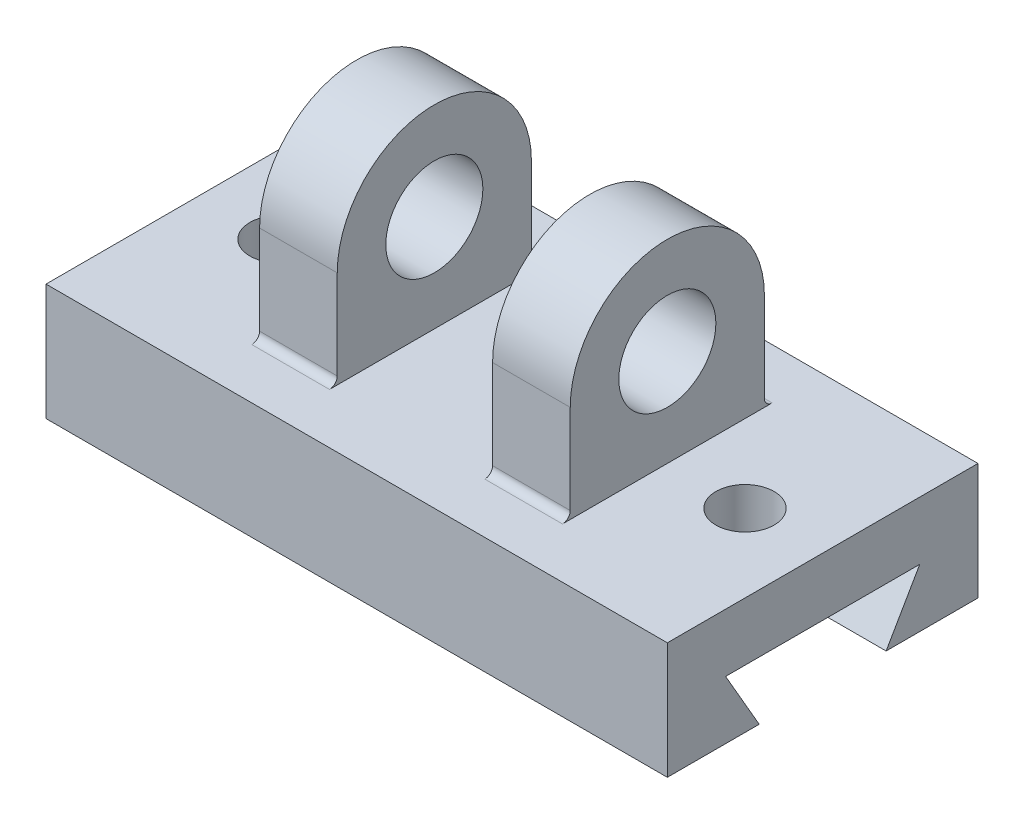
ISO-10303-21;
HEADER;
FILE_DESCRIPTION(('STEP AP214'),'2;1');
FILE_NAME('part.step','',(''),(''),'','','');
FILE_SCHEMA(('AUTOMOTIVE_DESIGN { 1 0 10303 214 1 1 1 1 }'));
ENDSEC;
DATA;
#1=APPLICATION_CONTEXT('core data for automotive mechanical design processes');
#2=APPLICATION_PROTOCOL_DEFINITION('international standard','automotive_design',2000,#1);
#3=PRODUCT_CONTEXT('',#1,'mechanical');
#4=PRODUCT('Part','Part','',(#3));
#5=PRODUCT_RELATED_PRODUCT_CATEGORY('part','',(#4));
#6=PRODUCT_DEFINITION_FORMATION('','',#4);
#7=PRODUCT_DEFINITION_CONTEXT('part definition',#1,'design');
#8=PRODUCT_DEFINITION('design','',#6,#7);
#9=PRODUCT_DEFINITION_SHAPE('','',#8);
#10=(LENGTH_UNIT() NAMED_UNIT(*) SI_UNIT(.MILLI.,.METRE.));
#11=(NAMED_UNIT(*) PLANE_ANGLE_UNIT() SI_UNIT($,.RADIAN.));
#12=(NAMED_UNIT(*) SI_UNIT($,.STERADIAN.) SOLID_ANGLE_UNIT());
#13=UNCERTAINTY_MEASURE_WITH_UNIT(LENGTH_MEASURE(1.E-05),#10,'distance_accuracy_value','');
#14=(GEOMETRIC_REPRESENTATION_CONTEXT(3) GLOBAL_UNCERTAINTY_ASSIGNED_CONTEXT((#13)) GLOBAL_UNIT_ASSIGNED_CONTEXT((#10,
#11,#12)) REPRESENTATION_CONTEXT('',''));
#15=CARTESIAN_POINT('',(0.,0.,0.));
#16=DIRECTION('',(0.,0.,1.));
#17=DIRECTION('',(1.,0.,0.));
#18=AXIS2_PLACEMENT_3D('',#15,#16,#17);
#19=CARTESIAN_POINT('',(-20.,50.,65.));
#20=DIRECTION('',(0.,0.,1.));
#21=DIRECTION('',(1.,0.,0.));
#22=AXIS2_PLACEMENT_3D('',#19,#20,#21);
#23=PLANE('',#22);
#24=DIRECTION('',(0.,-1.,0.));
#25=VECTOR('',#24,1.);
#26=CARTESIAN_POINT('',(-40.,50.,65.));
#27=LINE('',#26,#25);
#28=CARTESIAN_POINT('',(-40.,25.,65.));
#29=VERTEX_POINT('',#28);
#30=CARTESIAN_POINT('',(-40.,1.99999999999999,65.));
#31=VERTEX_POINT('',#30);
#32=EDGE_CURVE('E183',#29,#31,#27,.T.);
#33=ORIENTED_EDGE('',*,*,#32,.T.);
#34=DIRECTION('',(-1.,0.,0.));
#35=VECTOR('',#34,1.);
#36=CARTESIAN_POINT('',(-20.,1.99999999999999,65.));
#37=LINE('',#36,#35);
#38=CARTESIAN_POINT('',(-20.,1.99999999999999,65.));
#39=VERTEX_POINT('',#38);
#40=EDGE_CURVE('E60',#31,#39,#37,.F.);
#41=ORIENTED_EDGE('',*,*,#40,.T.);
#42=DIRECTION('',(0.,-1.,0.));
#43=VECTOR('',#42,1.);
#44=CARTESIAN_POINT('',(-20.,50.,65.));
#45=LINE('',#44,#43);
#46=CARTESIAN_POINT('',(-20.,25.,65.));
#47=VERTEX_POINT('',#46);
#48=EDGE_CURVE('E206',#47,#39,#45,.T.);
#49=ORIENTED_EDGE('',*,*,#48,.F.);
#50=DIRECTION('',(1.,0.,0.));
#51=VECTOR('',#50,1.);
#52=CARTESIAN_POINT('',(-40.,25.,65.));
#53=LINE('',#52,#51);
#54=EDGE_CURVE('E186',#29,#47,#53,.T.);
#55=ORIENTED_EDGE('',*,*,#54,.F.);
#56=EDGE_LOOP('',(#33,#41,#49,#55));
#57=FACE_BOUND('',#56,.T.);
#58=ADVANCED_FACE('F39',(#57),#23,.T.);
#59=CARTESIAN_POINT('',(20.,50.,15.));
#60=DIRECTION('',(1.,0.,0.));
#61=DIRECTION('',(0.,0.,-1.));
#62=AXIS2_PLACEMENT_3D('',#59,#60,#61);
#63=PLANE('',#62);
#64=CARTESIAN_POINT('',(20.,25.,40.));
#65=DIRECTION('',(1.,0.,0.));
#66=DIRECTION('',(0.,0.,-1.));
#67=AXIS2_PLACEMENT_3D('',#64,#65,#66);
#68=CIRCLE('',#67,12.5);
#69=CARTESIAN_POINT('',(20.,25.,27.5));
#70=VERTEX_POINT('',#69);
#71=EDGE_CURVE('E236',#70,#70,#68,.F.);
#72=ORIENTED_EDGE('',*,*,#71,.F.);
#73=EDGE_LOOP('',(#72));
#74=FACE_BOUND('',#73,.T.);
#75=CARTESIAN_POINT('',(20.,25.,40.));
#76=DIRECTION('',(1.,0.,0.));
#77=DIRECTION('',(0.,0.,-1.));
#78=AXIS2_PLACEMENT_3D('',#75,#76,#77);
#79=CIRCLE('',#78,25.);
#80=CARTESIAN_POINT('',(20.,25.,15.));
#81=VERTEX_POINT('',#80);
#82=CARTESIAN_POINT('',(20.,25.,65.));
#83=VERTEX_POINT('',#82);
#84=EDGE_CURVE('E247',#81,#83,#79,.T.);
#85=ORIENTED_EDGE('',*,*,#84,.F.);
#86=DIRECTION('',(0.,-1.,0.));
#87=VECTOR('',#86,1.);
#88=CARTESIAN_POINT('',(20.,50.,15.));
#89=LINE('',#88,#87);
#90=CARTESIAN_POINT('',(20.,2.,15.));
#91=VERTEX_POINT('',#90);
#92=EDGE_CURVE('E259',#81,#91,#89,.T.);
#93=ORIENTED_EDGE('',*,*,#92,.T.);
#94=CARTESIAN_POINT('',(20.,2.,13.));
#95=DIRECTION('',(1.,0.,0.));
#96=DIRECTION('',(0.,0.,-1.));
#97=AXIS2_PLACEMENT_3D('',#94,#95,#96);
#98=CIRCLE('',#97,2.);
#99=CARTESIAN_POINT('',(20.,0.,13.));
#100=VERTEX_POINT('',#99);
#101=EDGE_CURVE('E328',#91,#100,#98,.T.);
#102=ORIENTED_EDGE('',*,*,#101,.T.);
#103=DIRECTION('',(0.,0.,1.));
#104=VECTOR('',#103,1.);
#105=CARTESIAN_POINT('',(20.,0.,15.));
#106=LINE('',#105,#104);
#107=CARTESIAN_POINT('',(20.,0.,67.));
#108=VERTEX_POINT('',#107);
#109=EDGE_CURVE('E253',#100,#108,#106,.T.);
#110=ORIENTED_EDGE('',*,*,#109,.T.);
#111=CARTESIAN_POINT('',(20.,1.99999999999999,67.));
#112=DIRECTION('',(1.,0.,0.));
#113=DIRECTION('',(0.,0.,-1.));
#114=AXIS2_PLACEMENT_3D('',#111,#112,#113);
#115=CIRCLE('',#114,2.);
#116=CARTESIAN_POINT('',(20.,1.99999999999999,65.));
#117=VERTEX_POINT('',#116);
#118=EDGE_CURVE('E336',#108,#117,#115,.T.);
#119=ORIENTED_EDGE('',*,*,#118,.T.);
#120=DIRECTION('',(0.,-1.,0.));
#121=VECTOR('',#120,1.);
#122=CARTESIAN_POINT('',(20.,50.,65.));
#123=LINE('',#122,#121);
#124=EDGE_CURVE('E268',#83,#117,#123,.T.);
#125=ORIENTED_EDGE('',*,*,#124,.F.);
#126=EDGE_LOOP('',(#85,#93,#102,#110,#119,#125));
#127=FACE_BOUND('',#126,.T.);
#128=ADVANCED_FACE('F340',(#74,#127),#63,.F.);
#129=CARTESIAN_POINT('',(40.,50.,15.));
#130=DIRECTION('',(-1.,0.,0.));
#131=DIRECTION('',(0.,0.,1.));
#132=AXIS2_PLACEMENT_3D('',#129,#130,#131);
#133=PLANE('',#132);
#134=CARTESIAN_POINT('',(40.,25.,40.));
#135=DIRECTION('',(1.,0.,0.));
#136=DIRECTION('',(0.,0.,-1.));
#137=AXIS2_PLACEMENT_3D('',#134,#135,#136);
#138=CIRCLE('',#137,12.5);
#139=CARTESIAN_POINT('',(40.,25.,27.5));
#140=VERTEX_POINT('',#139);
#141=EDGE_CURVE('E233',#140,#140,#138,.T.);
#142=ORIENTED_EDGE('',*,*,#141,.F.);
#143=EDGE_LOOP('',(#142));
#144=FACE_BOUND('',#143,.T.);
#145=DIRECTION('',(0.,-1.,0.));
#146=VECTOR('',#145,1.);
#147=CARTESIAN_POINT('',(40.,50.,15.));
#148=LINE('',#147,#146);
#149=CARTESIAN_POINT('',(40.,25.,15.));
#150=VERTEX_POINT('',#149);
#151=CARTESIAN_POINT('',(40.,2.,15.));
#152=VERTEX_POINT('',#151);
#153=EDGE_CURVE('E262',#150,#152,#148,.T.);
#154=ORIENTED_EDGE('',*,*,#153,.F.);
#155=CARTESIAN_POINT('',(40.,25.,40.));
#156=DIRECTION('',(-1.,0.,0.));
#157=DIRECTION('',(0.,0.,-1.));
#158=AXIS2_PLACEMENT_3D('',#155,#156,#157);
#159=CIRCLE('',#158,25.);
#160=CARTESIAN_POINT('',(40.,25.,65.));
#161=VERTEX_POINT('',#160);
#162=EDGE_CURVE('E242',#161,#150,#159,.T.);
#163=ORIENTED_EDGE('',*,*,#162,.F.);
#164=DIRECTION('',(0.,-1.,0.));
#165=VECTOR('',#164,1.);
#166=CARTESIAN_POINT('',(40.,50.,65.));
#167=LINE('',#166,#165);
#168=CARTESIAN_POINT('',(40.,1.99999999999999,65.));
#169=VERTEX_POINT('',#168);
#170=EDGE_CURVE('E265',#161,#169,#167,.T.);
#171=ORIENTED_EDGE('',*,*,#170,.T.);
#172=CARTESIAN_POINT('',(40.,1.99999999999999,67.));
#173=DIRECTION('',(-1.,0.,0.));
#174=DIRECTION('',(0.,0.,1.));
#175=AXIS2_PLACEMENT_3D('',#172,#173,#174);
#176=CIRCLE('',#175,2.);
#177=CARTESIAN_POINT('',(40.,0.,67.));
#178=VERTEX_POINT('',#177);
#179=EDGE_CURVE('E333',#169,#178,#176,.T.);
#180=ORIENTED_EDGE('',*,*,#179,.T.);
#181=DIRECTION('',(0.,0.,-1.));
#182=VECTOR('',#181,1.);
#183=CARTESIAN_POINT('',(40.,0.,15.));
#184=LINE('',#183,#182);
#185=CARTESIAN_POINT('',(40.,0.,13.));
#186=VERTEX_POINT('',#185);
#187=EDGE_CURVE('E257',#178,#186,#184,.T.);
#188=ORIENTED_EDGE('',*,*,#187,.T.);
#189=CARTESIAN_POINT('',(40.,2.,13.));
#190=DIRECTION('',(-1.,0.,0.));
#191=DIRECTION('',(0.,0.,1.));
#192=AXIS2_PLACEMENT_3D('',#189,#190,#191);
#193=CIRCLE('',#192,2.);
#194=EDGE_CURVE('E331',#186,#152,#193,.T.);
#195=ORIENTED_EDGE('',*,*,#194,.T.);
#196=EDGE_LOOP('',(#154,#163,#171,#180,#188,#195));
#197=FACE_BOUND('',#196,.T.);
#198=ADVANCED_FACE('F350',(#144,#197),#133,.F.);
#199=CARTESIAN_POINT('',(20.,50.,15.));
#200=DIRECTION('',(0.,0.,1.));
#201=DIRECTION('',(0.,-1.,0.));
#202=AXIS2_PLACEMENT_3D('',#199,#200,#201);
#203=PLANE('',#202);
#204=ORIENTED_EDGE('',*,*,#153,.T.);
#205=DIRECTION('',(-1.,0.,0.));
#206=VECTOR('',#205,1.);
#207=CARTESIAN_POINT('',(20.,2.,15.));
#208=LINE('',#207,#206);
#209=EDGE_CURVE('E317',#152,#91,#208,.T.);
#210=ORIENTED_EDGE('',*,*,#209,.T.);
#211=ORIENTED_EDGE('',*,*,#92,.F.);
#212=DIRECTION('',(-1.,0.,0.));
#213=VECTOR('',#212,1.);
#214=CARTESIAN_POINT('',(40.,25.,15.));
#215=LINE('',#214,#213);
#216=EDGE_CURVE('E239',#150,#81,#215,.T.);
#217=ORIENTED_EDGE('',*,*,#216,.F.);
#218=EDGE_LOOP('',(#204,#210,#211,#217));
#219=FACE_BOUND('',#218,.T.);
#220=ADVANCED_FACE('F357',(#219),#203,.F.);
#221=CARTESIAN_POINT('',(80.,0.,0.));
#222=DIRECTION('',(0.,-1.,0.));
#223=DIRECTION('',(0.,0.,-1.));
#224=AXIS2_PLACEMENT_3D('',#221,#222,#223);
#225=PLANE('',#224);
#226=CARTESIAN_POINT('',(-60.,0.,40.));
#227=DIRECTION('',(0.,-1.,0.));
#228=DIRECTION('',(0.,0.,1.));
#229=AXIS2_PLACEMENT_3D('',#226,#227,#228);
#230=CIRCLE('',#229,7.50000000000001);
#231=CARTESIAN_POINT('',(-60.,0.,47.5));
#232=VERTEX_POINT('',#231);
#233=EDGE_CURVE('E576',#232,#232,#230,.T.);
#234=ORIENTED_EDGE('',*,*,#233,.T.);
#235=EDGE_LOOP('',(#234));
#236=FACE_BOUND('',#235,.T.);
#237=DIRECTION('',(1.,0.,0.));
#238=VECTOR('',#237,1.);
#239=CARTESIAN_POINT('',(80.,0.,13.));
#240=LINE('',#239,#238);
#241=CARTESIAN_POINT('',(-40.,0.,13.));
#242=VERTEX_POINT('',#241);
#243=CARTESIAN_POINT('',(-20.,0.,13.));
#244=VERTEX_POINT('',#243);
#245=EDGE_CURVE('E313',#242,#244,#240,.T.);
#246=ORIENTED_EDGE('',*,*,#245,.T.);
#247=DIRECTION('',(0.,0.,1.));
#248=VECTOR('',#247,1.);
#249=CARTESIAN_POINT('',(-20.,0.,15.));
#250=LINE('',#249,#248);
#251=CARTESIAN_POINT('',(-20.,0.,67.));
#252=VERTEX_POINT('',#251);
#253=EDGE_CURVE('E569',#244,#252,#250,.T.);
#254=ORIENTED_EDGE('',*,*,#253,.T.);
#255=DIRECTION('',(-1.,0.,0.));
#256=VECTOR('',#255,1.);
#257=CARTESIAN_POINT('',(80.,0.,67.0000000000001));
#258=LINE('',#257,#256);
#259=CARTESIAN_POINT('',(-40.,0.,67.));
#260=VERTEX_POINT('',#259);
#261=EDGE_CURVE('E304',#252,#260,#258,.T.);
#262=ORIENTED_EDGE('',*,*,#261,.T.);
#263=DIRECTION('',(0.,0.,-1.));
#264=VECTOR('',#263,1.);
#265=CARTESIAN_POINT('',(-40.,0.,15.));
#266=LINE('',#265,#264);
#267=EDGE_CURVE('E571',#260,#242,#266,.T.);
#268=ORIENTED_EDGE('',*,*,#267,.T.);
#269=EDGE_LOOP('',(#246,#254,#262,#268));
#270=FACE_BOUND('',#269,.T.);
#271=CARTESIAN_POINT('',(60.,0.,40.));
#272=DIRECTION('',(0.,1.,0.));
#273=DIRECTION('',(0.,0.,1.));
#274=AXIS2_PLACEMENT_3D('',#271,#272,#273);
#275=CIRCLE('',#274,7.50000000000001);
#276=CARTESIAN_POINT('',(60.,0.,47.5));
#277=VERTEX_POINT('',#276);
#278=EDGE_CURVE('E249',#277,#277,#275,.T.);
#279=ORIENTED_EDGE('',*,*,#278,.F.);
#280=EDGE_LOOP('',(#279));
#281=FACE_BOUND('',#280,.T.);
#282=DIRECTION('',(-1.,0.,0.));
#283=VECTOR('',#282,1.);
#284=CARTESIAN_POINT('',(80.,0.,0.));
#285=LINE('',#284,#283);
#286=CARTESIAN_POINT('',(80.,0.,0.));
#287=VERTEX_POINT('',#286);
#288=CARTESIAN_POINT('',(-80.,0.,0.));
#289=VERTEX_POINT('',#288);
#290=EDGE_CURVE('E302',#287,#289,#285,.T.);
#291=ORIENTED_EDGE('',*,*,#290,.T.);
#292=DIRECTION('',(0.,0.,1.));
#293=VECTOR('',#292,1.);
#294=CARTESIAN_POINT('',(-80.,0.,0.));
#295=LINE('',#294,#293);
#296=CARTESIAN_POINT('',(-80.,0.,80.));
#297=VERTEX_POINT('',#296);
#298=EDGE_CURVE('E230',#289,#297,#295,.T.);
#299=ORIENTED_EDGE('',*,*,#298,.T.);
#300=DIRECTION('',(-1.,0.,0.));
#301=VECTOR('',#300,1.);
#302=CARTESIAN_POINT('',(80.,0.,80.));
#303=LINE('',#302,#301);
#304=CARTESIAN_POINT('',(80.,0.,80.));
#305=VERTEX_POINT('',#304);
#306=EDGE_CURVE('E300',#305,#297,#303,.T.);
#307=ORIENTED_EDGE('',*,*,#306,.F.);
#308=DIRECTION('',(0.,0.,1.));
#309=VECTOR('',#308,1.);
#310=CARTESIAN_POINT('',(80.,0.,0.));
#311=LINE('',#310,#309);
#312=EDGE_CURVE('E274',#287,#305,#311,.T.);
#313=ORIENTED_EDGE('',*,*,#312,.F.);
#314=EDGE_LOOP('',(#291,#299,#307,#313));
#315=FACE_BOUND('',#314,.T.);
#316=ORIENTED_EDGE('',*,*,#109,.F.);
#317=DIRECTION('',(-1.,0.,0.));
#318=VECTOR('',#317,1.);
#319=CARTESIAN_POINT('',(40.,0.,13.));
#320=LINE('',#319,#318);
#321=EDGE_CURVE('E310',#100,#186,#320,.F.);
#322=ORIENTED_EDGE('',*,*,#321,.T.);
#323=ORIENTED_EDGE('',*,*,#187,.F.);
#324=DIRECTION('',(1.,0.,0.));
#325=VECTOR('',#324,1.);
#326=CARTESIAN_POINT('',(20.,0.,67.));
#327=LINE('',#326,#325);
#328=EDGE_CURVE('E307',#178,#108,#327,.F.);
#329=ORIENTED_EDGE('',*,*,#328,.T.);
#330=EDGE_LOOP('',(#316,#322,#323,#329));
#331=FACE_BOUND('',#330,.T.);
#332=ADVANCED_FACE('F364',(#236,#270,#281,#315,#331),#225,.F.);
#333=CARTESIAN_POINT('',(80.,0.,0.));
#334=DIRECTION('',(0.,0.,1.));
#335=DIRECTION('',(0.,-1.,0.));
#336=AXIS2_PLACEMENT_3D('',#333,#334,#335);
#337=PLANE('',#336);
#338=DIRECTION('',(-1.,0.,0.));
#339=VECTOR('',#338,1.);
#340=CARTESIAN_POINT('',(80.,-30.,0.));
#341=LINE('',#340,#339);
#342=CARTESIAN_POINT('',(80.,-30.,0.));
#343=VERTEX_POINT('',#342);
#344=CARTESIAN_POINT('',(-80.,-30.,0.));
#345=VERTEX_POINT('',#344);
#346=EDGE_CURVE('E288',#343,#345,#341,.T.);
#347=ORIENTED_EDGE('',*,*,#346,.T.);
#348=DIRECTION('',(0.,1.,0.));
#349=VECTOR('',#348,1.);
#350=CARTESIAN_POINT('',(-80.,0.,0.));
#351=LINE('',#350,#349);
#352=EDGE_CURVE('E204',#345,#289,#351,.T.);
#353=ORIENTED_EDGE('',*,*,#352,.T.);
#354=ORIENTED_EDGE('',*,*,#290,.F.);
#355=DIRECTION('',(0.,1.,0.));
#356=VECTOR('',#355,1.);
#357=CARTESIAN_POINT('',(80.,0.,0.));
#358=LINE('',#357,#356);
#359=EDGE_CURVE('E271',#343,#287,#358,.T.);
#360=ORIENTED_EDGE('',*,*,#359,.F.);
#361=EDGE_LOOP('',(#347,#353,#354,#360));
#362=FACE_BOUND('',#361,.T.);
#363=ADVANCED_FACE('F366',(#362),#337,.F.);
#364=CARTESIAN_POINT('',(80.,0.,80.));
#365=DIRECTION('',(0.,0.,-1.));
#366=DIRECTION('',(0.,1.,0.));
#367=AXIS2_PLACEMENT_3D('',#364,#365,#366);
#368=PLANE('',#367);
#369=ORIENTED_EDGE('',*,*,#306,.T.);
#370=DIRECTION('',(0.,-1.,0.));
#371=VECTOR('',#370,1.);
#372=CARTESIAN_POINT('',(-80.,0.,80.));
#373=LINE('',#372,#371);
#374=CARTESIAN_POINT('',(-80.,-30.,80.));
#375=VERTEX_POINT('',#374);
#376=EDGE_CURVE('E227',#297,#375,#373,.T.);
#377=ORIENTED_EDGE('',*,*,#376,.T.);
#378=DIRECTION('',(-1.,0.,0.));
#379=VECTOR('',#378,1.);
#380=CARTESIAN_POINT('',(80.,-30.,80.));
#381=LINE('',#380,#379);
#382=CARTESIAN_POINT('',(80.,-30.,80.));
#383=VERTEX_POINT('',#382);
#384=EDGE_CURVE('E298',#383,#375,#381,.T.);
#385=ORIENTED_EDGE('',*,*,#384,.F.);
#386=DIRECTION('',(0.,-1.,0.));
#387=VECTOR('',#386,1.);
#388=CARTESIAN_POINT('',(80.,0.,80.));
#389=LINE('',#388,#387);
#390=EDGE_CURVE('E276',#305,#383,#389,.T.);
#391=ORIENTED_EDGE('',*,*,#390,.F.);
#392=EDGE_LOOP('',(#369,#377,#385,#391));
#393=FACE_BOUND('',#392,.T.);
#394=ADVANCED_FACE('F374',(#393),#368,.F.);
#395=CARTESIAN_POINT('',(80.,-30.,56.3397459621557));
#396=DIRECTION('',(0.,1.,0.));
#397=DIRECTION('',(0.,0.,1.));
#398=AXIS2_PLACEMENT_3D('',#395,#396,#397);
#399=PLANE('',#398);
#400=ORIENTED_EDGE('',*,*,#384,.T.);
#401=DIRECTION('',(0.,0.,-1.));
#402=VECTOR('',#401,1.);
#403=CARTESIAN_POINT('',(-80.,-30.,56.3397459621557));
#404=LINE('',#403,#402);
#405=CARTESIAN_POINT('',(-80.,-30.,56.3397459621557));
#406=VERTEX_POINT('',#405);
#407=EDGE_CURVE('E224',#375,#406,#404,.T.);
#408=ORIENTED_EDGE('',*,*,#407,.T.);
#409=DIRECTION('',(-1.,0.,0.));
#410=VECTOR('',#409,1.);
#411=CARTESIAN_POINT('',(80.,-30.,56.3397459621557));
#412=LINE('',#411,#410);
#413=CARTESIAN_POINT('',(80.,-30.,56.3397459621557));
#414=VERTEX_POINT('',#413);
#415=EDGE_CURVE('E296',#414,#406,#412,.T.);
#416=ORIENTED_EDGE('',*,*,#415,.F.);
#417=DIRECTION('',(0.,0.,-1.));
#418=VECTOR('',#417,1.);
#419=CARTESIAN_POINT('',(80.,-30.,56.3397459621557));
#420=LINE('',#419,#418);
#421=EDGE_CURVE('E278',#383,#414,#420,.T.);
#422=ORIENTED_EDGE('',*,*,#421,.F.);
#423=EDGE_LOOP('',(#400,#408,#416,#422));
#424=FACE_BOUND('',#423,.T.);
#425=ADVANCED_FACE('F438',(#424),#399,.F.);
#426=CARTESIAN_POINT('',(80.,-15.,65.));
#427=DIRECTION('',(0.,-0.499999999999998,0.86602540378444));
#428=DIRECTION('',(0.,-0.86602540378444,-0.499999999999998));
#429=AXIS2_PLACEMENT_3D('',#426,#427,#428);
#430=PLANE('',#429);
#431=ORIENTED_EDGE('',*,*,#415,.T.);
#432=DIRECTION('',(0.,0.86602540378444,0.499999999999998));
#433=VECTOR('',#432,1.);
#434=CARTESIAN_POINT('',(-80.,-15.,65.));
#435=LINE('',#434,#433);
#436=CARTESIAN_POINT('',(-80.,-15.,65.));
#437=VERTEX_POINT('',#436);
#438=EDGE_CURVE('E221',#406,#437,#435,.T.);
#439=ORIENTED_EDGE('',*,*,#438,.T.);
#440=DIRECTION('',(-1.,0.,0.));
#441=VECTOR('',#440,1.);
#442=CARTESIAN_POINT('',(80.,-15.,65.));
#443=LINE('',#442,#441);
#444=CARTESIAN_POINT('',(80.,-15.,65.));
#445=VERTEX_POINT('',#444);
#446=EDGE_CURVE('E294',#445,#437,#443,.T.);
#447=ORIENTED_EDGE('',*,*,#446,.F.);
#448=DIRECTION('',(0.,0.86602540378444,0.499999999999998));
#449=VECTOR('',#448,1.);
#450=CARTESIAN_POINT('',(80.,-15.,65.));
#451=LINE('',#450,#449);
#452=EDGE_CURVE('E280',#414,#445,#451,.T.);
#453=ORIENTED_EDGE('',*,*,#452,.F.);
#454=EDGE_LOOP('',(#431,#439,#447,#453));
#455=FACE_BOUND('',#454,.T.);
#456=ADVANCED_FACE('F434',(#455),#430,.F.);
#457=CARTESIAN_POINT('',(80.,-15.,65.));
#458=DIRECTION('',(0.,1.,0.));
#459=DIRECTION('',(0.,0.,1.));
#460=AXIS2_PLACEMENT_3D('',#457,#458,#459);
#461=PLANE('',#460);
#462=CARTESIAN_POINT('',(-60.,-15.,40.));
#463=DIRECTION('',(0.,-1.,0.));
#464=DIRECTION('',(0.,0.,1.));
#465=AXIS2_PLACEMENT_3D('',#462,#463,#464);
#466=CIRCLE('',#465,7.50000000000001);
#467=CARTESIAN_POINT('',(-60.,-15.,47.5));
#468=VERTEX_POINT('',#467);
#469=EDGE_CURVE('E575',#468,#468,#466,.T.);
#470=ORIENTED_EDGE('',*,*,#469,.F.);
#471=EDGE_LOOP('',(#470));
#472=FACE_BOUND('',#471,.T.);
#473=CARTESIAN_POINT('',(60.,-15.,40.));
#474=DIRECTION('',(0.,1.,0.));
#475=DIRECTION('',(0.,0.,1.));
#476=AXIS2_PLACEMENT_3D('',#473,#474,#475);
#477=CIRCLE('',#476,7.50000000000001);
#478=CARTESIAN_POINT('',(60.,-15.,47.5));
#479=VERTEX_POINT('',#478);
#480=EDGE_CURVE('E250',#479,#479,#477,.T.);
#481=ORIENTED_EDGE('',*,*,#480,.T.);
#482=EDGE_LOOP('',(#481));
#483=FACE_BOUND('',#482,.T.);
#484=ORIENTED_EDGE('',*,*,#446,.T.);
#485=DIRECTION('',(0.,0.,-1.));
#486=VECTOR('',#485,1.);
#487=CARTESIAN_POINT('',(-80.,-15.,65.));
#488=LINE('',#487,#486);
#489=CARTESIAN_POINT('',(-80.,-15.,15.));
#490=VERTEX_POINT('',#489);
#491=EDGE_CURVE('E218',#437,#490,#488,.T.);
#492=ORIENTED_EDGE('',*,*,#491,.T.);
#493=DIRECTION('',(-1.,0.,0.));
#494=VECTOR('',#493,1.);
#495=CARTESIAN_POINT('',(80.,-15.,15.));
#496=LINE('',#495,#494);
#497=CARTESIAN_POINT('',(80.,-15.,15.));
#498=VERTEX_POINT('',#497);
#499=EDGE_CURVE('E292',#498,#490,#496,.T.);
#500=ORIENTED_EDGE('',*,*,#499,.F.);
#501=DIRECTION('',(0.,0.,-1.));
#502=VECTOR('',#501,1.);
#503=CARTESIAN_POINT('',(80.,-15.,65.));
#504=LINE('',#503,#502);
#505=EDGE_CURVE('E282',#445,#498,#504,.T.);
#506=ORIENTED_EDGE('',*,*,#505,.F.);
#507=EDGE_LOOP('',(#484,#492,#500,#506));
#508=FACE_BOUND('',#507,.T.);
#509=ADVANCED_FACE('F430',(#472,#483,#508),#461,.F.);
#510=CARTESIAN_POINT('',(80.,-15.,15.));
#511=DIRECTION('',(0.,-0.500000000000004,-0.866025403784436));
#512=DIRECTION('',(0.,0.866025403784436,-0.500000000000004));
#513=AXIS2_PLACEMENT_3D('',#510,#511,#512);
#514=PLANE('',#513);
#515=ORIENTED_EDGE('',*,*,#499,.T.);
#516=DIRECTION('',(0.,-0.866025403784436,0.500000000000004));
#517=VECTOR('',#516,1.);
#518=CARTESIAN_POINT('',(-80.,-15.,15.));
#519=LINE('',#518,#517);
#520=CARTESIAN_POINT('',(-80.,-30.,23.6602540378445));
#521=VERTEX_POINT('',#520);
#522=EDGE_CURVE('E215',#490,#521,#519,.T.);
#523=ORIENTED_EDGE('',*,*,#522,.T.);
#524=DIRECTION('',(-1.,0.,0.));
#525=VECTOR('',#524,1.);
#526=CARTESIAN_POINT('',(80.,-30.,23.6602540378445));
#527=LINE('',#526,#525);
#528=CARTESIAN_POINT('',(80.,-30.,23.6602540378445));
#529=VERTEX_POINT('',#528);
#530=EDGE_CURVE('E290',#529,#521,#527,.T.);
#531=ORIENTED_EDGE('',*,*,#530,.F.);
#532=DIRECTION('',(0.,-0.866025403784436,0.500000000000004));
#533=VECTOR('',#532,1.);
#534=CARTESIAN_POINT('',(80.,-15.,15.));
#535=LINE('',#534,#533);
#536=EDGE_CURVE('E284',#498,#529,#535,.T.);
#537=ORIENTED_EDGE('',*,*,#536,.F.);
#538=EDGE_LOOP('',(#515,#523,#531,#537));
#539=FACE_BOUND('',#538,.T.);
#540=ADVANCED_FACE('F426',(#539),#514,.F.);
#541=CARTESIAN_POINT('',(80.,-30.,0.));
#542=DIRECTION('',(0.,1.,0.));
#543=DIRECTION('',(0.,0.,1.));
#544=AXIS2_PLACEMENT_3D('',#541,#542,#543);
#545=PLANE('',#544);
#546=ORIENTED_EDGE('',*,*,#530,.T.);
#547=DIRECTION('',(0.,0.,-1.));
#548=VECTOR('',#547,1.);
#549=CARTESIAN_POINT('',(-80.,-30.,0.));
#550=LINE('',#549,#548);
#551=EDGE_CURVE('E212',#521,#345,#550,.T.);
#552=ORIENTED_EDGE('',*,*,#551,.T.);
#553=ORIENTED_EDGE('',*,*,#346,.F.);
#554=DIRECTION('',(0.,0.,-1.));
#555=VECTOR('',#554,1.);
#556=CARTESIAN_POINT('',(80.,-30.,0.));
#557=LINE('',#556,#555);
#558=EDGE_CURVE('E286',#529,#343,#557,.T.);
#559=ORIENTED_EDGE('',*,*,#558,.F.);
#560=EDGE_LOOP('',(#546,#552,#553,#559));
#561=FACE_BOUND('',#560,.T.);
#562=ADVANCED_FACE('F422',(#561),#545,.F.);
#563=CARTESIAN_POINT('',(80.,0.,0.));
#564=DIRECTION('',(-1.,0.,0.));
#565=DIRECTION('',(0.,0.,1.));
#566=AXIS2_PLACEMENT_3D('',#563,#564,#565);
#567=PLANE('',#566);
#568=ORIENTED_EDGE('',*,*,#359,.T.);
#569=ORIENTED_EDGE('',*,*,#312,.T.);
#570=ORIENTED_EDGE('',*,*,#390,.T.);
#571=ORIENTED_EDGE('',*,*,#421,.T.);
#572=ORIENTED_EDGE('',*,*,#452,.T.);
#573=ORIENTED_EDGE('',*,*,#505,.T.);
#574=ORIENTED_EDGE('',*,*,#536,.T.);
#575=ORIENTED_EDGE('',*,*,#558,.T.);
#576=EDGE_LOOP('',(#568,#569,#570,#571,#572,#573,#574,#575));
#577=FACE_BOUND('',#576,.T.);
#578=ADVANCED_FACE('F418',(#577),#567,.F.);
#579=CARTESIAN_POINT('',(20.,50.,65.));
#580=DIRECTION('',(0.,0.,-1.));
#581=DIRECTION('',(-1.,0.,0.));
#582=AXIS2_PLACEMENT_3D('',#579,#580,#581);
#583=PLANE('',#582);
#584=ORIENTED_EDGE('',*,*,#124,.T.);
#585=DIRECTION('',(1.,0.,0.));
#586=VECTOR('',#585,1.);
#587=CARTESIAN_POINT('',(40.,2.,65.));
#588=LINE('',#587,#586);
#589=EDGE_CURVE('E320',#117,#169,#588,.T.);
#590=ORIENTED_EDGE('',*,*,#589,.T.);
#591=ORIENTED_EDGE('',*,*,#170,.F.);
#592=DIRECTION('',(-1.,0.,0.));
#593=VECTOR('',#592,1.);
#594=CARTESIAN_POINT('',(40.,25.,65.));
#595=LINE('',#594,#593);
#596=EDGE_CURVE('E244',#161,#83,#595,.T.);
#597=ORIENTED_EDGE('',*,*,#596,.T.);
#598=EDGE_LOOP('',(#584,#590,#591,#597));
#599=FACE_BOUND('',#598,.T.);
#600=ADVANCED_FACE('F345',(#599),#583,.F.);
#601=CARTESIAN_POINT('',(60.,-15.,40.));
#602=DIRECTION('',(0.,1.,0.));
#603=DIRECTION('',(0.,0.,1.));
#604=AXIS2_PLACEMENT_3D('',#601,#602,#603);
#605=CYLINDRICAL_SURFACE('',#604,7.50000000000001);
#606=ORIENTED_EDGE('',*,*,#480,.F.);
#607=EDGE_LOOP('',(#606));
#608=FACE_BOUND('',#607,.T.);
#609=ORIENTED_EDGE('',*,*,#278,.T.);
#610=EDGE_LOOP('',(#609));
#611=FACE_BOUND('',#610,.T.);
#612=ADVANCED_FACE('F411',(#608,#611),#605,.F.);
#613=CARTESIAN_POINT('',(40.,25.,40.));
#614=DIRECTION('',(-1.,0.,0.));
#615=DIRECTION('',(0.,0.,1.));
#616=AXIS2_PLACEMENT_3D('',#613,#614,#615);
#617=CYLINDRICAL_SURFACE('',#616,25.);
#618=ORIENTED_EDGE('',*,*,#84,.T.);
#619=ORIENTED_EDGE('',*,*,#596,.F.);
#620=ORIENTED_EDGE('',*,*,#162,.T.);
#621=ORIENTED_EDGE('',*,*,#216,.T.);
#622=EDGE_LOOP('',(#618,#619,#620,#621));
#623=FACE_BOUND('',#622,.T.);
#624=ADVANCED_FACE('F354',(#623),#617,.T.);
#625=CARTESIAN_POINT('',(40.,25.,40.));
#626=DIRECTION('',(-1.,0.,0.));
#627=DIRECTION('',(0.,0.,1.));
#628=AXIS2_PLACEMENT_3D('',#625,#626,#627);
#629=CYLINDRICAL_SURFACE('',#628,12.5);
#630=ORIENTED_EDGE('',*,*,#141,.T.);
#631=EDGE_LOOP('',(#630));
#632=FACE_BOUND('',#631,.T.);
#633=ORIENTED_EDGE('',*,*,#71,.T.);
#634=EDGE_LOOP('',(#633));
#635=FACE_BOUND('',#634,.T.);
#636=ADVANCED_FACE('F404',(#632,#635),#629,.F.);
#637=CARTESIAN_POINT('',(-80.,0.,0.));
#638=DIRECTION('',(1.,0.,0.));
#639=DIRECTION('',(0.,0.,1.));
#640=AXIS2_PLACEMENT_3D('',#637,#638,#639);
#641=PLANE('',#640);
#642=ORIENTED_EDGE('',*,*,#352,.F.);
#643=ORIENTED_EDGE('',*,*,#551,.F.);
#644=ORIENTED_EDGE('',*,*,#522,.F.);
#645=ORIENTED_EDGE('',*,*,#491,.F.);
#646=ORIENTED_EDGE('',*,*,#438,.F.);
#647=ORIENTED_EDGE('',*,*,#407,.F.);
#648=ORIENTED_EDGE('',*,*,#376,.F.);
#649=ORIENTED_EDGE('',*,*,#298,.F.);
#650=EDGE_LOOP('',(#642,#643,#644,#645,#646,#647,#648,#649));
#651=FACE_BOUND('',#650,.T.);
#652=ADVANCED_FACE('F400',(#651),#641,.F.);
#653=CARTESIAN_POINT('',(-20.,50.,15.));
#654=DIRECTION('',(1.,0.,0.));
#655=DIRECTION('',(0.,0.,-1.));
#656=AXIS2_PLACEMENT_3D('',#653,#654,#655);
#657=PLANE('',#656);
#658=DIRECTION('',(0.,-1.,0.));
#659=VECTOR('',#658,1.);
#660=CARTESIAN_POINT('',(-20.,50.,15.));
#661=LINE('',#660,#659);
#662=CARTESIAN_POINT('',(-20.,25.,15.));
#663=VERTEX_POINT('',#662);
#664=CARTESIAN_POINT('',(-20.,1.99999999999999,15.));
#665=VERTEX_POINT('',#664);
#666=EDGE_CURVE('E202',#663,#665,#661,.T.);
#667=ORIENTED_EDGE('',*,*,#666,.F.);
#668=CARTESIAN_POINT('',(-20.,25.,40.));
#669=DIRECTION('',(1.,0.,0.));
#670=DIRECTION('',(0.,0.,-1.));
#671=AXIS2_PLACEMENT_3D('',#668,#669,#670);
#672=CIRCLE('',#671,25.);
#673=EDGE_CURVE('E193',#47,#663,#672,.F.);
#674=ORIENTED_EDGE('',*,*,#673,.F.);
#675=ORIENTED_EDGE('',*,*,#48,.T.);
#676=CARTESIAN_POINT('',(-20.,1.99999999999999,67.));
#677=DIRECTION('',(1.,0.,0.));
#678=DIRECTION('',(0.,0.,-1.));
#679=AXIS2_PLACEMENT_3D('',#676,#677,#678);
#680=CIRCLE('',#679,2.);
#681=EDGE_CURVE('E11',#39,#252,#680,.F.);
#682=ORIENTED_EDGE('',*,*,#681,.T.);
#683=ORIENTED_EDGE('',*,*,#253,.F.);
#684=CARTESIAN_POINT('',(-20.,2.,13.));
#685=DIRECTION('',(1.,0.,0.));
#686=DIRECTION('',(0.,0.,-1.));
#687=AXIS2_PLACEMENT_3D('',#684,#685,#686);
#688=CIRCLE('',#687,2.);
#689=EDGE_CURVE('E324',#244,#665,#688,.F.);
#690=ORIENTED_EDGE('',*,*,#689,.T.);
#691=EDGE_LOOP('',(#667,#674,#675,#682,#683,#690));
#692=FACE_BOUND('',#691,.T.);
#693=CARTESIAN_POINT('',(-20.,25.,40.));
#694=DIRECTION('',(1.,0.,0.));
#695=DIRECTION('',(0.,0.,-1.));
#696=AXIS2_PLACEMENT_3D('',#693,#694,#695);
#697=CIRCLE('',#696,12.5);
#698=CARTESIAN_POINT('',(-20.,25.,27.5));
#699=VERTEX_POINT('',#698);
#700=EDGE_CURVE('E187',#699,#699,#697,.T.);
#701=ORIENTED_EDGE('',*,*,#700,.F.);
#702=EDGE_LOOP('',(#701));
#703=FACE_BOUND('',#702,.T.);
#704=ADVANCED_FACE('F397',(#692,#703),#657,.T.);
#705=CARTESIAN_POINT('',(-20.,50.,15.));
#706=DIRECTION('',(0.,0.,-1.));
#707=DIRECTION('',(0.,1.,0.));
#708=AXIS2_PLACEMENT_3D('',#705,#706,#707);
#709=PLANE('',#708);
#710=ORIENTED_EDGE('',*,*,#666,.T.);
#711=DIRECTION('',(1.,0.,0.));
#712=VECTOR('',#711,1.);
#713=CARTESIAN_POINT('',(-20.,1.99999999999999,15.));
#714=LINE('',#713,#712);
#715=CARTESIAN_POINT('',(-40.,1.99999999999999,15.));
#716=VERTEX_POINT('',#715);
#717=EDGE_CURVE('E201',#665,#716,#714,.F.);
#718=ORIENTED_EDGE('',*,*,#717,.T.);
#719=DIRECTION('',(0.,-1.,0.));
#720=VECTOR('',#719,1.);
#721=CARTESIAN_POINT('',(-40.,50.,15.));
#722=LINE('',#721,#720);
#723=CARTESIAN_POINT('',(-40.,25.,15.));
#724=VERTEX_POINT('',#723);
#725=EDGE_CURVE('E181',#724,#716,#722,.T.);
#726=ORIENTED_EDGE('',*,*,#725,.F.);
#727=DIRECTION('',(1.,0.,0.));
#728=VECTOR('',#727,1.);
#729=CARTESIAN_POINT('',(-40.,25.,15.));
#730=LINE('',#729,#728);
#731=EDGE_CURVE('E190',#724,#663,#730,.T.);
#732=ORIENTED_EDGE('',*,*,#731,.T.);
#733=EDGE_LOOP('',(#710,#718,#726,#732));
#734=FACE_BOUND('',#733,.T.);
#735=ADVANCED_FACE('F199',(#734),#709,.T.);
#736=CARTESIAN_POINT('',(-40.,50.,15.));
#737=DIRECTION('',(-1.,0.,0.));
#738=DIRECTION('',(0.,0.,1.));
#739=AXIS2_PLACEMENT_3D('',#736,#737,#738);
#740=PLANE('',#739);
#741=CARTESIAN_POINT('',(-40.,25.,40.));
#742=DIRECTION('',(-1.,0.,0.));
#743=DIRECTION('',(0.,0.,-1.));
#744=AXIS2_PLACEMENT_3D('',#741,#742,#743);
#745=CIRCLE('',#744,25.);
#746=EDGE_CURVE('E175',#29,#724,#745,.T.);
#747=ORIENTED_EDGE('',*,*,#746,.T.);
#748=ORIENTED_EDGE('',*,*,#725,.T.);
#749=CARTESIAN_POINT('',(-40.,2.,13.));
#750=DIRECTION('',(-1.,0.,0.));
#751=DIRECTION('',(0.,0.,1.));
#752=AXIS2_PLACEMENT_3D('',#749,#750,#751);
#753=CIRCLE('',#752,2.);
#754=EDGE_CURVE('E326',#716,#242,#753,.F.);
#755=ORIENTED_EDGE('',*,*,#754,.T.);
#756=ORIENTED_EDGE('',*,*,#267,.F.);
#757=CARTESIAN_POINT('',(-40.,1.99999999999999,67.));
#758=DIRECTION('',(-1.,0.,0.));
#759=DIRECTION('',(0.,0.,1.));
#760=AXIS2_PLACEMENT_3D('',#757,#758,#759);
#761=CIRCLE('',#760,2.);
#762=EDGE_CURVE('E47',#260,#31,#761,.F.);
#763=ORIENTED_EDGE('',*,*,#762,.T.);
#764=ORIENTED_EDGE('',*,*,#32,.F.);
#765=EDGE_LOOP('',(#747,#748,#755,#756,#763,#764));
#766=FACE_BOUND('',#765,.T.);
#767=CARTESIAN_POINT('',(-40.,25.,40.));
#768=DIRECTION('',(1.,0.,0.));
#769=DIRECTION('',(0.,0.,-1.));
#770=AXIS2_PLACEMENT_3D('',#767,#768,#769);
#771=CIRCLE('',#770,12.5);
#772=CARTESIAN_POINT('',(-40.,25.,27.5));
#773=VERTEX_POINT('',#772);
#774=EDGE_CURVE('E197',#773,#773,#771,.T.);
#775=ORIENTED_EDGE('',*,*,#774,.T.);
#776=EDGE_LOOP('',(#775));
#777=FACE_BOUND('',#776,.T.);
#778=ADVANCED_FACE('F177',(#766,#777),#740,.T.);
#779=CARTESIAN_POINT('',(-60.,-15.,40.));
#780=DIRECTION('',(0.,1.,0.));
#781=DIRECTION('',(0.,0.,1.));
#782=AXIS2_PLACEMENT_3D('',#779,#780,#781);
#783=CYLINDRICAL_SURFACE('',#782,7.50000000000001);
#784=ORIENTED_EDGE('',*,*,#469,.T.);
#785=EDGE_LOOP('',(#784));
#786=FACE_BOUND('',#785,.T.);
#787=ORIENTED_EDGE('',*,*,#233,.F.);
#788=EDGE_LOOP('',(#787));
#789=FACE_BOUND('',#788,.T.);
#790=ADVANCED_FACE('F391',(#786,#789),#783,.F.);
#791=CARTESIAN_POINT('',(-40.,25.,40.));
#792=DIRECTION('',(1.,0.,0.));
#793=DIRECTION('',(0.,0.,-1.));
#794=AXIS2_PLACEMENT_3D('',#791,#792,#793);
#795=CYLINDRICAL_SURFACE('',#794,25.);
#796=ORIENTED_EDGE('',*,*,#673,.T.);
#797=ORIENTED_EDGE('',*,*,#731,.F.);
#798=ORIENTED_EDGE('',*,*,#746,.F.);
#799=ORIENTED_EDGE('',*,*,#54,.T.);
#800=EDGE_LOOP('',(#796,#797,#798,#799));
#801=FACE_BOUND('',#800,.T.);
#802=ADVANCED_FACE('F191',(#801),#795,.T.);
#803=CARTESIAN_POINT('',(-40.,25.,40.));
#804=DIRECTION('',(1.,0.,0.));
#805=DIRECTION('',(0.,0.,-1.));
#806=AXIS2_PLACEMENT_3D('',#803,#804,#805);
#807=CYLINDRICAL_SURFACE('',#806,12.5);
#808=ORIENTED_EDGE('',*,*,#700,.T.);
#809=EDGE_LOOP('',(#808));
#810=FACE_BOUND('',#809,.T.);
#811=ORIENTED_EDGE('',*,*,#774,.F.);
#812=EDGE_LOOP('',(#811));
#813=FACE_BOUND('',#812,.T.);
#814=ADVANCED_FACE('F517',(#810,#813),#807,.F.);
#815=CARTESIAN_POINT('',(80.,2.,13.));
#816=DIRECTION('',(1.,0.,0.));
#817=DIRECTION('',(0.,0.,-1.));
#818=AXIS2_PLACEMENT_3D('',#815,#816,#817);
#819=CYLINDRICAL_SURFACE('',#818,2.);
#820=ORIENTED_EDGE('',*,*,#754,.F.);
#821=ORIENTED_EDGE('',*,*,#717,.F.);
#822=ORIENTED_EDGE('',*,*,#689,.F.);
#823=ORIENTED_EDGE('',*,*,#245,.F.);
#824=EDGE_LOOP('',(#820,#821,#822,#823));
#825=FACE_BOUND('',#824,.T.);
#826=ADVANCED_FACE('F520',(#825),#819,.F.);
#827=CARTESIAN_POINT('',(20.,2.,13.));
#828=DIRECTION('',(1.,0.,0.));
#829=DIRECTION('',(0.,0.,-1.));
#830=AXIS2_PLACEMENT_3D('',#827,#828,#829);
#831=CYLINDRICAL_SURFACE('',#830,2.);
#832=ORIENTED_EDGE('',*,*,#194,.F.);
#833=ORIENTED_EDGE('',*,*,#321,.F.);
#834=ORIENTED_EDGE('',*,*,#101,.F.);
#835=ORIENTED_EDGE('',*,*,#209,.F.);
#836=EDGE_LOOP('',(#832,#833,#834,#835));
#837=FACE_BOUND('',#836,.T.);
#838=ADVANCED_FACE('F362',(#837),#831,.F.);
#839=CARTESIAN_POINT('',(20.,1.99999999999999,67.));
#840=DIRECTION('',(-1.,0.,0.));
#841=DIRECTION('',(0.,0.,1.));
#842=AXIS2_PLACEMENT_3D('',#839,#840,#841);
#843=CYLINDRICAL_SURFACE('',#842,2.);
#844=ORIENTED_EDGE('',*,*,#118,.F.);
#845=ORIENTED_EDGE('',*,*,#328,.F.);
#846=ORIENTED_EDGE('',*,*,#179,.F.);
#847=ORIENTED_EDGE('',*,*,#589,.F.);
#848=EDGE_LOOP('',(#844,#845,#846,#847));
#849=FACE_BOUND('',#848,.T.);
#850=ADVANCED_FACE('F347',(#849),#843,.F.);
#851=CARTESIAN_POINT('',(80.,1.99999999999999,67.0000000000001));
#852=DIRECTION('',(-1.,0.,0.));
#853=DIRECTION('',(0.,0.,1.));
#854=AXIS2_PLACEMENT_3D('',#851,#852,#853);
#855=CYLINDRICAL_SURFACE('',#854,2.);
#856=ORIENTED_EDGE('',*,*,#681,.F.);
#857=ORIENTED_EDGE('',*,*,#40,.F.);
#858=ORIENTED_EDGE('',*,*,#762,.F.);
#859=ORIENTED_EDGE('',*,*,#261,.F.);
#860=EDGE_LOOP('',(#856,#857,#858,#859));
#861=FACE_BOUND('',#860,.T.);
#862=ADVANCED_FACE('F41',(#861),#855,.F.);
#863=CLOSED_SHELL('',(#58,#128,#198,#220,#332,#363,#394,#425,#456,#509,#540,#562,#578,#600,#612,
#624,#636,#652,#704,#735,#778,#790,#802,#814,#826,#838,#850,#862));
#864=MANIFOLD_SOLID_BREP('B2',#863);
#865=ADVANCED_BREP_SHAPE_REPRESENTATION('',(#18,#864),#14);
#866=SHAPE_DEFINITION_REPRESENTATION(#9,#865);
ENDSEC;
END-ISO-10303-21;
